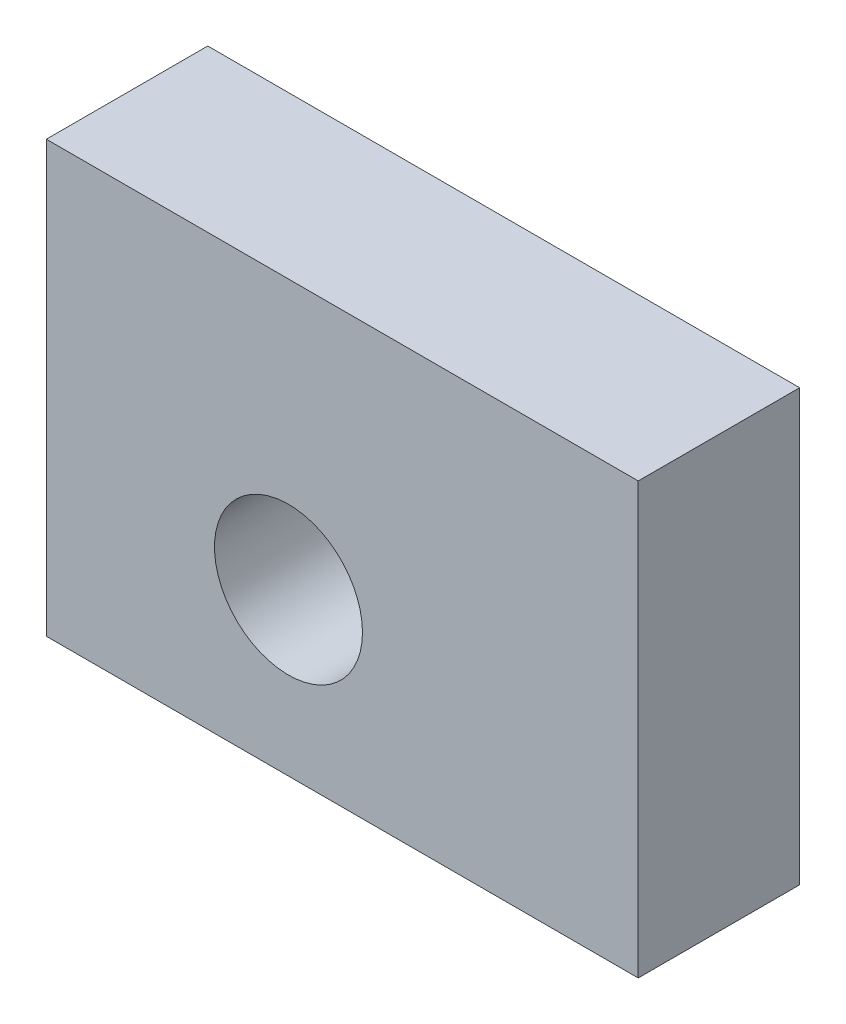
ISO-10303-21;
HEADER;
FILE_DESCRIPTION(('STEP AP214'),'2;1');
FILE_NAME('part.step','',(''),(''),'','','');
FILE_SCHEMA(('AUTOMOTIVE_DESIGN { 1 0 10303 214 1 1 1 1 }'));
ENDSEC;
DATA;
#1=APPLICATION_CONTEXT('core data for automotive mechanical design processes');
#2=APPLICATION_PROTOCOL_DEFINITION('international standard','automotive_design',2000,#1);
#3=PRODUCT_CONTEXT('',#1,'mechanical');
#4=PRODUCT('Part','Part','',(#3));
#5=PRODUCT_RELATED_PRODUCT_CATEGORY('part','',(#4));
#6=PRODUCT_DEFINITION_FORMATION('','',#4);
#7=PRODUCT_DEFINITION_CONTEXT('part definition',#1,'design');
#8=PRODUCT_DEFINITION('design','',#6,#7);
#9=PRODUCT_DEFINITION_SHAPE('','',#8);
#10=(LENGTH_UNIT() NAMED_UNIT(*) SI_UNIT(.MILLI.,.METRE.));
#11=(NAMED_UNIT(*) PLANE_ANGLE_UNIT() SI_UNIT($,.RADIAN.));
#12=(NAMED_UNIT(*) SI_UNIT($,.STERADIAN.) SOLID_ANGLE_UNIT());
#13=UNCERTAINTY_MEASURE_WITH_UNIT(LENGTH_MEASURE(1.E-05),#10,'distance_accuracy_value','');
#14=(GEOMETRIC_REPRESENTATION_CONTEXT(3) GLOBAL_UNCERTAINTY_ASSIGNED_CONTEXT((#13)) GLOBAL_UNIT_ASSIGNED_CONTEXT((#10,
#11,#12)) REPRESENTATION_CONTEXT('',''));
#15=CARTESIAN_POINT('',(0.,0.,0.));
#16=DIRECTION('',(0.,0.,1.));
#17=DIRECTION('',(1.,0.,0.));
#18=AXIS2_PLACEMENT_3D('',#15,#16,#17);
#19=CARTESIAN_POINT('',(0.,0.,6.));
#20=DIRECTION('',(0.,0.,1.));
#21=DIRECTION('',(1.,0.,0.));
#22=AXIS2_PLACEMENT_3D('',#19,#20,#21);
#23=PLANE('',#22);
#24=DIRECTION('',(1.,0.,0.));
#25=VECTOR('',#24,1.);
#26=CARTESIAN_POINT('',(0.,0.,6.));
#27=LINE('',#26,#25);
#28=CARTESIAN_POINT('',(0.,0.,6.));
#29=VERTEX_POINT('',#28);
#30=CARTESIAN_POINT('',(22.,0.,6.));
#31=VERTEX_POINT('',#30);
#32=EDGE_CURVE('E85',#29,#31,#27,.T.);
#33=ORIENTED_EDGE('',*,*,#32,.T.);
#34=DIRECTION('',(0.,1.,0.));
#35=VECTOR('',#34,1.);
#36=CARTESIAN_POINT('',(22.,0.,6.));
#37=LINE('',#36,#35);
#38=CARTESIAN_POINT('',(22.,16.,6.));
#39=VERTEX_POINT('',#38);
#40=EDGE_CURVE('E80',#31,#39,#37,.T.);
#41=ORIENTED_EDGE('',*,*,#40,.T.);
#42=DIRECTION('',(-1.,0.,0.));
#43=VECTOR('',#42,1.);
#44=CARTESIAN_POINT('',(0.,16.,6.));
#45=LINE('',#44,#43);
#46=CARTESIAN_POINT('',(0.,16.,6.));
#47=VERTEX_POINT('',#46);
#48=EDGE_CURVE('E83',#39,#47,#45,.T.);
#49=ORIENTED_EDGE('',*,*,#48,.T.);
#50=DIRECTION('',(0.,-1.,0.));
#51=VECTOR('',#50,1.);
#52=CARTESIAN_POINT('',(0.,0.,6.));
#53=LINE('',#52,#51);
#54=EDGE_CURVE('E50',#47,#29,#53,.T.);
#55=ORIENTED_EDGE('',*,*,#54,.T.);
#56=EDGE_LOOP('',(#33,#41,#49,#55));
#57=FACE_BOUND('',#56,.T.);
#58=CARTESIAN_POINT('',(9.,6.,6.));
#59=DIRECTION('',(0.,0.,1.));
#60=DIRECTION('',(1.,0.,0.));
#61=AXIS2_PLACEMENT_3D('',#58,#59,#60);
#62=CIRCLE('',#61,2.75);
#63=CARTESIAN_POINT('',(11.75,6.,6.));
#64=VERTEX_POINT('',#63);
#65=EDGE_CURVE('E100',#64,#64,#62,.T.);
#66=ORIENTED_EDGE('',*,*,#65,.F.);
#67=EDGE_LOOP('',(#66));
#68=FACE_BOUND('',#67,.T.);
#69=ADVANCED_FACE('F33',(#57,#68),#23,.T.);
#70=CARTESIAN_POINT('',(0.,0.,0.));
#71=DIRECTION('',(0.,0.,1.));
#72=DIRECTION('',(1.,0.,0.));
#73=AXIS2_PLACEMENT_3D('',#70,#71,#72);
#74=PLANE('',#73);
#75=DIRECTION('',(1.,0.,0.));
#76=VECTOR('',#75,1.);
#77=CARTESIAN_POINT('',(0.,0.,0.));
#78=LINE('',#77,#76);
#79=CARTESIAN_POINT('',(0.,0.,0.));
#80=VERTEX_POINT('',#79);
#81=CARTESIAN_POINT('',(22.,0.,0.));
#82=VERTEX_POINT('',#81);
#83=EDGE_CURVE('E97',#80,#82,#78,.T.);
#84=ORIENTED_EDGE('',*,*,#83,.F.);
#85=DIRECTION('',(0.,-1.,0.));
#86=VECTOR('',#85,1.);
#87=CARTESIAN_POINT('',(0.,0.,0.));
#88=LINE('',#87,#86);
#89=CARTESIAN_POINT('',(0.,16.,0.));
#90=VERTEX_POINT('',#89);
#91=EDGE_CURVE('E73',#90,#80,#88,.T.);
#92=ORIENTED_EDGE('',*,*,#91,.F.);
#93=DIRECTION('',(-1.,0.,0.));
#94=VECTOR('',#93,1.);
#95=CARTESIAN_POINT('',(0.,16.,0.));
#96=LINE('',#95,#94);
#97=CARTESIAN_POINT('',(22.,16.,0.));
#98=VERTEX_POINT('',#97);
#99=EDGE_CURVE('E67',#98,#90,#96,.T.);
#100=ORIENTED_EDGE('',*,*,#99,.F.);
#101=DIRECTION('',(0.,1.,0.));
#102=VECTOR('',#101,1.);
#103=CARTESIAN_POINT('',(22.,0.,0.));
#104=LINE('',#103,#102);
#105=EDGE_CURVE('E89',#82,#98,#104,.T.);
#106=ORIENTED_EDGE('',*,*,#105,.F.);
#107=EDGE_LOOP('',(#84,#92,#100,#106));
#108=FACE_BOUND('',#107,.T.);
#109=CARTESIAN_POINT('',(9.,6.,0.));
#110=DIRECTION('',(0.,0.,1.));
#111=DIRECTION('',(1.,0.,0.));
#112=AXIS2_PLACEMENT_3D('',#109,#110,#111);
#113=CIRCLE('',#112,2.75);
#114=CARTESIAN_POINT('',(11.75,6.,0.));
#115=VERTEX_POINT('',#114);
#116=EDGE_CURVE('E112',#115,#115,#113,.T.);
#117=ORIENTED_EDGE('',*,*,#116,.T.);
#118=EDGE_LOOP('',(#117));
#119=FACE_BOUND('',#118,.T.);
#120=ADVANCED_FACE('F108',(#108,#119),#74,.F.);
#121=CARTESIAN_POINT('',(0.,0.,6.));
#122=DIRECTION('',(0.,1.,0.));
#123=DIRECTION('',(-1.,0.,0.));
#124=AXIS2_PLACEMENT_3D('',#121,#122,#123);
#125=PLANE('',#124);
#126=ORIENTED_EDGE('',*,*,#83,.T.);
#127=DIRECTION('',(0.,0.,-1.));
#128=VECTOR('',#127,1.);
#129=CARTESIAN_POINT('',(22.,0.,6.));
#130=LINE('',#129,#128);
#131=EDGE_CURVE('E11',#31,#82,#130,.T.);
#132=ORIENTED_EDGE('',*,*,#131,.F.);
#133=ORIENTED_EDGE('',*,*,#32,.F.);
#134=DIRECTION('',(0.,0.,-1.));
#135=VECTOR('',#134,1.);
#136=CARTESIAN_POINT('',(0.,0.,6.));
#137=LINE('',#136,#135);
#138=EDGE_CURVE('E93',#29,#80,#137,.T.);
#139=ORIENTED_EDGE('',*,*,#138,.T.);
#140=EDGE_LOOP('',(#126,#132,#133,#139));
#141=FACE_BOUND('',#140,.T.);
#142=ADVANCED_FACE('F35',(#141),#125,.F.);
#143=CARTESIAN_POINT('',(22.,0.,6.));
#144=DIRECTION('',(-1.,0.,0.));
#145=DIRECTION('',(0.,0.,1.));
#146=AXIS2_PLACEMENT_3D('',#143,#144,#145);
#147=PLANE('',#146);
#148=ORIENTED_EDGE('',*,*,#105,.T.);
#149=DIRECTION('',(0.,0.,-1.));
#150=VECTOR('',#149,1.);
#151=CARTESIAN_POINT('',(22.,16.,6.));
#152=LINE('',#151,#150);
#153=EDGE_CURVE('E42',#39,#98,#152,.T.);
#154=ORIENTED_EDGE('',*,*,#153,.F.);
#155=ORIENTED_EDGE('',*,*,#40,.F.);
#156=ORIENTED_EDGE('',*,*,#131,.T.);
#157=EDGE_LOOP('',(#148,#154,#155,#156));
#158=FACE_BOUND('',#157,.T.);
#159=ADVANCED_FACE('F88',(#158),#147,.F.);
#160=CARTESIAN_POINT('',(0.,16.,6.));
#161=DIRECTION('',(0.,-1.,0.));
#162=DIRECTION('',(1.,0.,0.));
#163=AXIS2_PLACEMENT_3D('',#160,#161,#162);
#164=PLANE('',#163);
#165=ORIENTED_EDGE('',*,*,#99,.T.);
#166=DIRECTION('',(0.,0.,-1.));
#167=VECTOR('',#166,1.);
#168=CARTESIAN_POINT('',(0.,16.,6.));
#169=LINE('',#168,#167);
#170=EDGE_CURVE('E90',#47,#90,#169,.T.);
#171=ORIENTED_EDGE('',*,*,#170,.F.);
#172=ORIENTED_EDGE('',*,*,#48,.F.);
#173=ORIENTED_EDGE('',*,*,#153,.T.);
#174=EDGE_LOOP('',(#165,#171,#172,#173));
#175=FACE_BOUND('',#174,.T.);
#176=ADVANCED_FACE('F91',(#175),#164,.F.);
#177=CARTESIAN_POINT('',(0.,0.,6.));
#178=DIRECTION('',(1.,0.,0.));
#179=DIRECTION('',(0.,0.,-1.));
#180=AXIS2_PLACEMENT_3D('',#177,#178,#179);
#181=PLANE('',#180);
#182=ORIENTED_EDGE('',*,*,#91,.T.);
#183=ORIENTED_EDGE('',*,*,#138,.F.);
#184=ORIENTED_EDGE('',*,*,#54,.F.);
#185=ORIENTED_EDGE('',*,*,#170,.T.);
#186=EDGE_LOOP('',(#182,#183,#184,#185));
#187=FACE_BOUND('',#186,.T.);
#188=ADVANCED_FACE('F105',(#187),#181,.F.);
#189=CARTESIAN_POINT('',(9.,6.,6.));
#190=DIRECTION('',(0.,0.,-1.));
#191=DIRECTION('',(-1.,0.,0.));
#192=AXIS2_PLACEMENT_3D('',#189,#190,#191);
#193=CYLINDRICAL_SURFACE('',#192,2.75);
#194=ORIENTED_EDGE('',*,*,#65,.T.);
#195=EDGE_LOOP('',(#194));
#196=FACE_BOUND('',#195,.T.);
#197=ORIENTED_EDGE('',*,*,#116,.F.);
#198=EDGE_LOOP('',(#197));
#199=FACE_BOUND('',#198,.T.);
#200=ADVANCED_FACE('F118',(#196,#199),#193,.F.);
#201=CLOSED_SHELL('',(#69,#120,#142,#159,#176,#188,#200));
#202=MANIFOLD_SOLID_BREP('B2',#201);
#203=ADVANCED_BREP_SHAPE_REPRESENTATION('',(#18,#202),#14);
#204=SHAPE_DEFINITION_REPRESENTATION(#9,#203);
ENDSEC;
END-ISO-10303-21;
